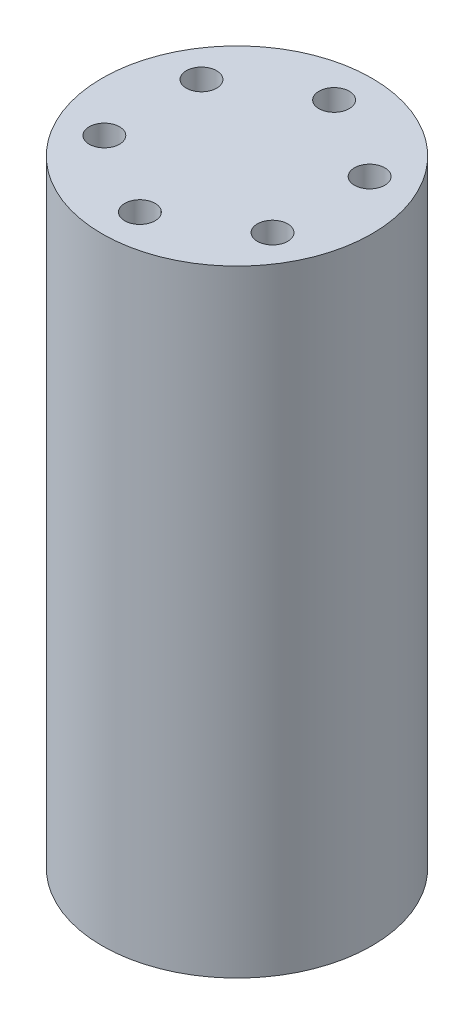
ISO-10303-21;
HEADER;
FILE_DESCRIPTION(('STEP AP214'),'2;1');
FILE_NAME('part.step','',(''),(''),'','','');
FILE_SCHEMA(('AUTOMOTIVE_DESIGN { 1 0 10303 214 1 1 1 1 }'));
ENDSEC;
DATA;
#1=APPLICATION_CONTEXT('core data for automotive mechanical design processes');
#2=APPLICATION_PROTOCOL_DEFINITION('international standard','automotive_design',2000,#1);
#3=PRODUCT_CONTEXT('',#1,'mechanical');
#4=PRODUCT('Part','Part','',(#3));
#5=PRODUCT_RELATED_PRODUCT_CATEGORY('part','',(#4));
#6=PRODUCT_DEFINITION_FORMATION('','',#4);
#7=PRODUCT_DEFINITION_CONTEXT('part definition',#1,'design');
#8=PRODUCT_DEFINITION('design','',#6,#7);
#9=PRODUCT_DEFINITION_SHAPE('','',#8);
#10=(LENGTH_UNIT() NAMED_UNIT(*) SI_UNIT(.MILLI.,.METRE.));
#11=(NAMED_UNIT(*) PLANE_ANGLE_UNIT() SI_UNIT($,.RADIAN.));
#12=(NAMED_UNIT(*) SI_UNIT($,.STERADIAN.) SOLID_ANGLE_UNIT());
#13=UNCERTAINTY_MEASURE_WITH_UNIT(LENGTH_MEASURE(1.E-05),#10,'distance_accuracy_value','');
#14=(GEOMETRIC_REPRESENTATION_CONTEXT(3) GLOBAL_UNCERTAINTY_ASSIGNED_CONTEXT((#13)) GLOBAL_UNIT_ASSIGNED_CONTEXT((#10,
#11,#12)) REPRESENTATION_CONTEXT('',''));
#15=CARTESIAN_POINT('',(0.,0.,0.));
#16=DIRECTION('',(0.,0.,1.));
#17=DIRECTION('',(1.,0.,0.));
#18=AXIS2_PLACEMENT_3D('',#15,#16,#17);
#19=CARTESIAN_POINT('',(0.,50.8,0.));
#20=DIRECTION('',(0.,-1.,0.));
#21=DIRECTION('',(0.,0.,-1.));
#22=AXIS2_PLACEMENT_3D('',#19,#20,#21);
#23=CYLINDRICAL_SURFACE('',#22,11.1125);
#24=CARTESIAN_POINT('',(0.,50.8,0.));
#25=DIRECTION('',(0.,1.,0.));
#26=DIRECTION('',(0.,0.,1.));
#27=AXIS2_PLACEMENT_3D('',#24,#25,#26);
#28=CIRCLE('',#27,11.1125);
#29=CARTESIAN_POINT('',(0.,50.8,11.1125));
#30=VERTEX_POINT('',#29);
#31=EDGE_CURVE('E10',#30,#30,#28,.T.);
#32=ORIENTED_EDGE('',*,*,#31,.F.);
#33=EDGE_LOOP('',(#32));
#34=FACE_BOUND('',#33,.T.);
#35=CARTESIAN_POINT('',(0.,0.,0.));
#36=DIRECTION('',(0.,1.,0.));
#37=DIRECTION('',(0.,0.,1.));
#38=AXIS2_PLACEMENT_3D('',#35,#36,#37);
#39=CIRCLE('',#38,11.1125);
#40=CARTESIAN_POINT('',(0.,0.,11.1125));
#41=VERTEX_POINT('',#40);
#42=EDGE_CURVE('E50',#41,#41,#39,.T.);
#43=ORIENTED_EDGE('',*,*,#42,.T.);
#44=EDGE_LOOP('',(#43));
#45=FACE_BOUND('',#44,.T.);
#46=ADVANCED_FACE('F47',(#34,#45),#23,.T.);
#47=CARTESIAN_POINT('',(0.,50.8,0.));
#48=DIRECTION('',(0.,1.,0.));
#49=DIRECTION('',(0.,0.,1.));
#50=AXIS2_PLACEMENT_3D('',#47,#48,#49);
#51=PLANE('',#50);
#52=CARTESIAN_POINT('',(0.,50.8,-8.));
#53=DIRECTION('',(0.,1.,0.));
#54=DIRECTION('',(0.,0.,1.));
#55=AXIS2_PLACEMENT_3D('',#52,#53,#54);
#56=CIRCLE('',#55,1.25);
#57=CARTESIAN_POINT('',(0.,50.8,-6.75));
#58=VERTEX_POINT('',#57);
#59=EDGE_CURVE('E91',#58,#58,#56,.T.);
#60=ORIENTED_EDGE('',*,*,#59,.F.);
#61=EDGE_LOOP('',(#60));
#62=FACE_BOUND('',#61,.T.);
#63=CARTESIAN_POINT('',(6.92820323027551,50.8,-4.));
#64=DIRECTION('',(0.,1.,0.));
#65=DIRECTION('',(0.,0.,1.));
#66=AXIS2_PLACEMENT_3D('',#63,#64,#65);
#67=CIRCLE('',#66,1.25);
#68=CARTESIAN_POINT('',(6.92820323027551,50.8,-2.75));
#69=VERTEX_POINT('',#68);
#70=EDGE_CURVE('E85',#69,#69,#67,.T.);
#71=ORIENTED_EDGE('',*,*,#70,.F.);
#72=EDGE_LOOP('',(#71));
#73=FACE_BOUND('',#72,.T.);
#74=CARTESIAN_POINT('',(6.92820323027551,50.8,4.));
#75=DIRECTION('',(0.,1.,0.));
#76=DIRECTION('',(0.,0.,1.));
#77=AXIS2_PLACEMENT_3D('',#74,#75,#76);
#78=CIRCLE('',#77,1.25);
#79=CARTESIAN_POINT('',(6.92820323027551,50.8,5.25));
#80=VERTEX_POINT('',#79);
#81=EDGE_CURVE('E79',#80,#80,#78,.T.);
#82=ORIENTED_EDGE('',*,*,#81,.F.);
#83=EDGE_LOOP('',(#82));
#84=FACE_BOUND('',#83,.T.);
#85=CARTESIAN_POINT('',(0.,50.8,8.));
#86=DIRECTION('',(0.,1.,0.));
#87=DIRECTION('',(0.,0.,1.));
#88=AXIS2_PLACEMENT_3D('',#85,#86,#87);
#89=CIRCLE('',#88,1.25);
#90=CARTESIAN_POINT('',(0.,50.8,9.25));
#91=VERTEX_POINT('',#90);
#92=EDGE_CURVE('E73',#91,#91,#89,.T.);
#93=ORIENTED_EDGE('',*,*,#92,.F.);
#94=EDGE_LOOP('',(#93));
#95=FACE_BOUND('',#94,.T.);
#96=CARTESIAN_POINT('',(-6.92820323027551,50.8,4.));
#97=DIRECTION('',(0.,1.,0.));
#98=DIRECTION('',(0.,0.,1.));
#99=AXIS2_PLACEMENT_3D('',#96,#97,#98);
#100=CIRCLE('',#99,1.25);
#101=CARTESIAN_POINT('',(-6.92820323027551,50.8,5.25));
#102=VERTEX_POINT('',#101);
#103=EDGE_CURVE('E67',#102,#102,#100,.T.);
#104=ORIENTED_EDGE('',*,*,#103,.F.);
#105=EDGE_LOOP('',(#104));
#106=FACE_BOUND('',#105,.T.);
#107=CARTESIAN_POINT('',(-6.92820323027551,50.8,-4.));
#108=DIRECTION('',(0.,1.,0.));
#109=DIRECTION('',(0.,0.,1.));
#110=AXIS2_PLACEMENT_3D('',#107,#108,#109);
#111=CIRCLE('',#110,1.25);
#112=CARTESIAN_POINT('',(-6.92820323027551,50.8,-2.75));
#113=VERTEX_POINT('',#112);
#114=EDGE_CURVE('E61',#113,#113,#111,.T.);
#115=ORIENTED_EDGE('',*,*,#114,.F.);
#116=EDGE_LOOP('',(#115));
#117=FACE_BOUND('',#116,.T.);
#118=ORIENTED_EDGE('',*,*,#31,.T.);
#119=EDGE_LOOP('',(#118));
#120=FACE_BOUND('',#119,.T.);
#121=ADVANCED_FACE('F97',(#62,#73,#84,#95,#106,#117,#120),#51,.T.);
#122=CARTESIAN_POINT('',(0.,0.,0.));
#123=DIRECTION('',(0.,1.,0.));
#124=DIRECTION('',(0.,0.,1.));
#125=AXIS2_PLACEMENT_3D('',#122,#123,#124);
#126=PLANE('',#125);
#127=CARTESIAN_POINT('',(0.,0.,-8.));
#128=DIRECTION('',(0.,1.,0.));
#129=DIRECTION('',(0.,0.,1.));
#130=AXIS2_PLACEMENT_3D('',#127,#128,#129);
#131=CIRCLE('',#130,1.24999999999999);
#132=CARTESIAN_POINT('',(0.,0.,-6.75000000000001));
#133=VERTEX_POINT('',#132);
#134=EDGE_CURVE('E88',#133,#133,#131,.T.);
#135=ORIENTED_EDGE('',*,*,#134,.T.);
#136=EDGE_LOOP('',(#135));
#137=FACE_BOUND('',#136,.T.);
#138=CARTESIAN_POINT('',(6.92820323027551,0.,-4.));
#139=DIRECTION('',(0.,1.,0.));
#140=DIRECTION('',(0.,0.,1.));
#141=AXIS2_PLACEMENT_3D('',#138,#139,#140);
#142=CIRCLE('',#141,1.24999999999999);
#143=CARTESIAN_POINT('',(6.92820323027551,0.,-2.75000000000001));
#144=VERTEX_POINT('',#143);
#145=EDGE_CURVE('E82',#144,#144,#142,.T.);
#146=ORIENTED_EDGE('',*,*,#145,.T.);
#147=EDGE_LOOP('',(#146));
#148=FACE_BOUND('',#147,.T.);
#149=CARTESIAN_POINT('',(6.92820323027551,0.,4.));
#150=DIRECTION('',(0.,1.,0.));
#151=DIRECTION('',(0.,0.,1.));
#152=AXIS2_PLACEMENT_3D('',#149,#150,#151);
#153=CIRCLE('',#152,1.24999999999999);
#154=CARTESIAN_POINT('',(6.92820323027551,0.,5.24999999999999));
#155=VERTEX_POINT('',#154);
#156=EDGE_CURVE('E76',#155,#155,#153,.T.);
#157=ORIENTED_EDGE('',*,*,#156,.T.);
#158=EDGE_LOOP('',(#157));
#159=FACE_BOUND('',#158,.T.);
#160=CARTESIAN_POINT('',(0.,0.,8.));
#161=DIRECTION('',(0.,1.,0.));
#162=DIRECTION('',(0.,0.,1.));
#163=AXIS2_PLACEMENT_3D('',#160,#161,#162);
#164=CIRCLE('',#163,1.24999999999999);
#165=CARTESIAN_POINT('',(0.,0.,9.24999999999999));
#166=VERTEX_POINT('',#165);
#167=EDGE_CURVE('E70',#166,#166,#164,.T.);
#168=ORIENTED_EDGE('',*,*,#167,.T.);
#169=EDGE_LOOP('',(#168));
#170=FACE_BOUND('',#169,.T.);
#171=CARTESIAN_POINT('',(-6.92820323027551,0.,4.));
#172=DIRECTION('',(0.,1.,0.));
#173=DIRECTION('',(0.,0.,1.));
#174=AXIS2_PLACEMENT_3D('',#171,#172,#173);
#175=CIRCLE('',#174,1.24999999999999);
#176=CARTESIAN_POINT('',(-6.92820323027551,0.,5.25));
#177=VERTEX_POINT('',#176);
#178=EDGE_CURVE('E64',#177,#177,#175,.T.);
#179=ORIENTED_EDGE('',*,*,#178,.T.);
#180=EDGE_LOOP('',(#179));
#181=FACE_BOUND('',#180,.T.);
#182=CARTESIAN_POINT('',(-6.92820323027551,0.,-4.));
#183=DIRECTION('',(0.,1.,0.));
#184=DIRECTION('',(0.,0.,1.));
#185=AXIS2_PLACEMENT_3D('',#182,#183,#184);
#186=CIRCLE('',#185,1.24999999999999);
#187=CARTESIAN_POINT('',(-6.92820323027551,0.,-2.75000000000001));
#188=VERTEX_POINT('',#187);
#189=EDGE_CURVE('E57',#188,#188,#186,.T.);
#190=ORIENTED_EDGE('',*,*,#189,.T.);
#191=EDGE_LOOP('',(#190));
#192=FACE_BOUND('',#191,.T.);
#193=ORIENTED_EDGE('',*,*,#42,.F.);
#194=EDGE_LOOP('',(#193));
#195=FACE_BOUND('',#194,.T.);
#196=ADVANCED_FACE('F100',(#137,#148,#159,#170,#181,#192,#195),#126,.F.);
#197=CARTESIAN_POINT('',(-6.92820323027551,50.8,-4.));
#198=DIRECTION('',(0.,1.,0.));
#199=DIRECTION('',(0.,0.,1.));
#200=AXIS2_PLACEMENT_3D('',#197,#198,#199);
#201=CYLINDRICAL_SURFACE('',#200,1.25);
#202=ORIENTED_EDGE('',*,*,#189,.F.);
#203=EDGE_LOOP('',(#202));
#204=FACE_BOUND('',#203,.T.);
#205=ORIENTED_EDGE('',*,*,#114,.T.);
#206=EDGE_LOOP('',(#205));
#207=FACE_BOUND('',#206,.T.);
#208=ADVANCED_FACE('F112',(#204,#207),#201,.F.);
#209=CARTESIAN_POINT('',(-6.92820323027551,50.8,4.));
#210=DIRECTION('',(0.,1.,0.));
#211=DIRECTION('',(0.,0.,1.));
#212=AXIS2_PLACEMENT_3D('',#209,#210,#211);
#213=CYLINDRICAL_SURFACE('',#212,1.25);
#214=ORIENTED_EDGE('',*,*,#178,.F.);
#215=EDGE_LOOP('',(#214));
#216=FACE_BOUND('',#215,.T.);
#217=ORIENTED_EDGE('',*,*,#103,.T.);
#218=EDGE_LOOP('',(#217));
#219=FACE_BOUND('',#218,.T.);
#220=ADVANCED_FACE('F114',(#216,#219),#213,.F.);
#221=CARTESIAN_POINT('',(0.,50.8,8.));
#222=DIRECTION('',(0.,1.,0.));
#223=DIRECTION('',(0.,0.,1.));
#224=AXIS2_PLACEMENT_3D('',#221,#222,#223);
#225=CYLINDRICAL_SURFACE('',#224,1.25);
#226=ORIENTED_EDGE('',*,*,#167,.F.);
#227=EDGE_LOOP('',(#226));
#228=FACE_BOUND('',#227,.T.);
#229=ORIENTED_EDGE('',*,*,#92,.T.);
#230=EDGE_LOOP('',(#229));
#231=FACE_BOUND('',#230,.T.);
#232=ADVANCED_FACE('F120',(#228,#231),#225,.F.);
#233=CARTESIAN_POINT('',(6.92820323027551,50.8,4.));
#234=DIRECTION('',(0.,1.,0.));
#235=DIRECTION('',(0.,0.,1.));
#236=AXIS2_PLACEMENT_3D('',#233,#234,#235);
#237=CYLINDRICAL_SURFACE('',#236,1.25);
#238=ORIENTED_EDGE('',*,*,#156,.F.);
#239=EDGE_LOOP('',(#238));
#240=FACE_BOUND('',#239,.T.);
#241=ORIENTED_EDGE('',*,*,#81,.T.);
#242=EDGE_LOOP('',(#241));
#243=FACE_BOUND('',#242,.T.);
#244=ADVANCED_FACE('F174',(#240,#243),#237,.F.);
#245=CARTESIAN_POINT('',(6.92820323027551,50.8,-4.));
#246=DIRECTION('',(0.,1.,0.));
#247=DIRECTION('',(0.,0.,1.));
#248=AXIS2_PLACEMENT_3D('',#245,#246,#247);
#249=CYLINDRICAL_SURFACE('',#248,1.25);
#250=ORIENTED_EDGE('',*,*,#145,.F.);
#251=EDGE_LOOP('',(#250));
#252=FACE_BOUND('',#251,.T.);
#253=ORIENTED_EDGE('',*,*,#70,.T.);
#254=EDGE_LOOP('',(#253));
#255=FACE_BOUND('',#254,.T.);
#256=ADVANCED_FACE('F188',(#252,#255),#249,.F.);
#257=CARTESIAN_POINT('',(0.,50.8,-8.));
#258=DIRECTION('',(0.,1.,0.));
#259=DIRECTION('',(0.,0.,1.));
#260=AXIS2_PLACEMENT_3D('',#257,#258,#259);
#261=CYLINDRICAL_SURFACE('',#260,1.25);
#262=ORIENTED_EDGE('',*,*,#134,.F.);
#263=EDGE_LOOP('',(#262));
#264=FACE_BOUND('',#263,.T.);
#265=ORIENTED_EDGE('',*,*,#59,.T.);
#266=EDGE_LOOP('',(#265));
#267=FACE_BOUND('',#266,.T.);
#268=ADVANCED_FACE('F95',(#264,#267),#261,.F.);
#269=CLOSED_SHELL('',(#46,#121,#196,#208,#220,#232,#244,#256,#268));
#270=MANIFOLD_SOLID_BREP('B2',#269);
#271=ADVANCED_BREP_SHAPE_REPRESENTATION('',(#18,#270),#14);
#272=SHAPE_DEFINITION_REPRESENTATION(#9,#271);
ENDSEC;
END-ISO-10303-21;
